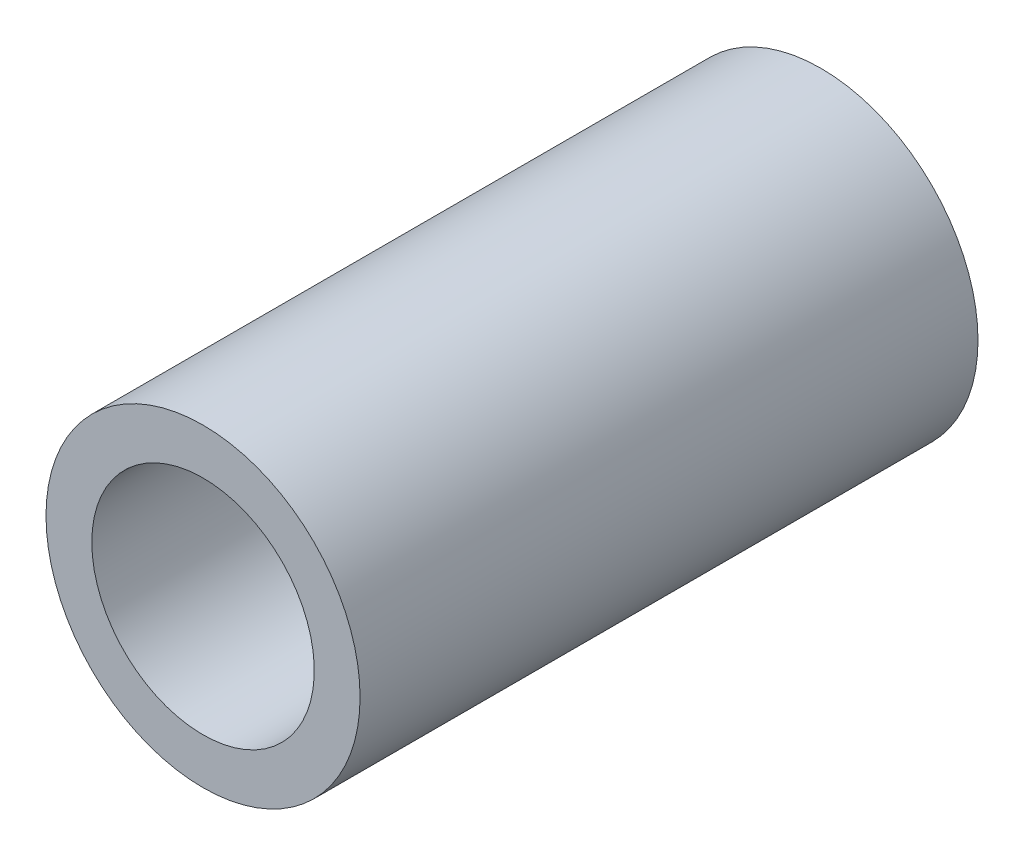
ISO-10303-21;
HEADER;
FILE_DESCRIPTION(('STEP AP214'),'2;1');
FILE_NAME('part.step','',(''),(''),'','','');
FILE_SCHEMA(('AUTOMOTIVE_DESIGN { 1 0 10303 214 1 1 1 1 }'));
ENDSEC;
DATA;
#1=APPLICATION_CONTEXT('core data for automotive mechanical design processes');
#2=APPLICATION_PROTOCOL_DEFINITION('international standard','automotive_design',2000,#1);
#3=PRODUCT_CONTEXT('',#1,'mechanical');
#4=PRODUCT('Part','Part','',(#3));
#5=PRODUCT_RELATED_PRODUCT_CATEGORY('part','',(#4));
#6=PRODUCT_DEFINITION_FORMATION('','',#4);
#7=PRODUCT_DEFINITION_CONTEXT('part definition',#1,'design');
#8=PRODUCT_DEFINITION('design','',#6,#7);
#9=PRODUCT_DEFINITION_SHAPE('','',#8);
#10=(LENGTH_UNIT() NAMED_UNIT(*) SI_UNIT(.MILLI.,.METRE.));
#11=(NAMED_UNIT(*) PLANE_ANGLE_UNIT() SI_UNIT($,.RADIAN.));
#12=(NAMED_UNIT(*) SI_UNIT($,.STERADIAN.) SOLID_ANGLE_UNIT());
#13=UNCERTAINTY_MEASURE_WITH_UNIT(LENGTH_MEASURE(1.E-05),#10,'distance_accuracy_value','');
#14=(GEOMETRIC_REPRESENTATION_CONTEXT(3) GLOBAL_UNCERTAINTY_ASSIGNED_CONTEXT((#13)) GLOBAL_UNIT_ASSIGNED_CONTEXT((#10,
#11,#12)) REPRESENTATION_CONTEXT('',''));
#15=CARTESIAN_POINT('',(0.,0.,0.));
#16=DIRECTION('',(0.,0.,1.));
#17=DIRECTION('',(1.,0.,0.));
#18=AXIS2_PLACEMENT_3D('',#15,#16,#17);
#19=CARTESIAN_POINT('',(0.,0.,23.61));
#20=DIRECTION('',(0.,0.,-1.));
#21=DIRECTION('',(-1.,0.,0.));
#22=AXIS2_PLACEMENT_3D('',#19,#20,#21);
#23=CYLINDRICAL_SURFACE('',#22,4.25);
#24=CARTESIAN_POINT('',(0.,0.,0.));
#25=DIRECTION('',(0.,0.,-1.));
#26=DIRECTION('',(-1.,0.,0.));
#27=AXIS2_PLACEMENT_3D('',#24,#25,#26);
#28=CIRCLE('',#27,4.25);
#29=CARTESIAN_POINT('',(-4.25,0.,0.));
#30=VERTEX_POINT('',#29);
#31=EDGE_CURVE('E27',#30,#30,#28,.T.);
#32=ORIENTED_EDGE('',*,*,#31,.T.);
#33=EDGE_LOOP('',(#32));
#34=FACE_BOUND('',#33,.T.);
#35=CARTESIAN_POINT('',(0.,0.,23.61));
#36=DIRECTION('',(0.,0.,-1.));
#37=DIRECTION('',(-1.,0.,0.));
#38=AXIS2_PLACEMENT_3D('',#35,#36,#37);
#39=CIRCLE('',#38,4.25);
#40=CARTESIAN_POINT('',(-4.25,0.,23.61));
#41=VERTEX_POINT('',#40);
#42=EDGE_CURVE('E18',#41,#41,#39,.T.);
#43=ORIENTED_EDGE('',*,*,#42,.F.);
#44=EDGE_LOOP('',(#43));
#45=FACE_BOUND('',#44,.T.);
#46=ADVANCED_FACE('F15',(#34,#45),#23,.F.);
#47=CARTESIAN_POINT('',(0.,0.,23.61));
#48=DIRECTION('',(0.,0.,1.));
#49=DIRECTION('',(1.,0.,0.));
#50=AXIS2_PLACEMENT_3D('',#47,#48,#49);
#51=PLANE('',#50);
#52=ORIENTED_EDGE('',*,*,#42,.T.);
#53=EDGE_LOOP('',(#52));
#54=FACE_BOUND('',#53,.T.);
#55=CARTESIAN_POINT('',(0.,0.,23.61));
#56=DIRECTION('',(0.,0.,-1.));
#57=DIRECTION('',(-1.,0.,0.));
#58=AXIS2_PLACEMENT_3D('',#55,#56,#57);
#59=CIRCLE('',#58,6.);
#60=CARTESIAN_POINT('',(-6.,0.,23.61));
#61=VERTEX_POINT('',#60);
#62=EDGE_CURVE('E22',#61,#61,#59,.T.);
#63=ORIENTED_EDGE('',*,*,#62,.F.);
#64=EDGE_LOOP('',(#63));
#65=FACE_BOUND('',#64,.T.);
#66=ADVANCED_FACE('F35',(#54,#65),#51,.T.);
#67=CARTESIAN_POINT('',(0.,0.,0.));
#68=DIRECTION('',(0.,0.,1.));
#69=DIRECTION('',(1.,0.,0.));
#70=AXIS2_PLACEMENT_3D('',#67,#68,#69);
#71=PLANE('',#70);
#72=ORIENTED_EDGE('',*,*,#31,.F.);
#73=EDGE_LOOP('',(#72));
#74=FACE_BOUND('',#73,.T.);
#75=CARTESIAN_POINT('',(0.,0.,0.));
#76=DIRECTION('',(0.,0.,-1.));
#77=DIRECTION('',(-1.,0.,0.));
#78=AXIS2_PLACEMENT_3D('',#75,#76,#77);
#79=CIRCLE('',#78,6.);
#80=CARTESIAN_POINT('',(-6.,0.,0.));
#81=VERTEX_POINT('',#80);
#82=EDGE_CURVE('E10',#81,#81,#79,.F.);
#83=ORIENTED_EDGE('',*,*,#82,.F.);
#84=EDGE_LOOP('',(#83));
#85=FACE_BOUND('',#84,.T.);
#86=ADVANCED_FACE('F43',(#74,#85),#71,.F.);
#87=CARTESIAN_POINT('',(0.,0.,23.61));
#88=DIRECTION('',(0.,0.,-1.));
#89=DIRECTION('',(-1.,0.,0.));
#90=AXIS2_PLACEMENT_3D('',#87,#88,#89);
#91=CYLINDRICAL_SURFACE('',#90,6.);
#92=ORIENTED_EDGE('',*,*,#82,.T.);
#93=EDGE_LOOP('',(#92));
#94=FACE_BOUND('',#93,.T.);
#95=ORIENTED_EDGE('',*,*,#62,.T.);
#96=EDGE_LOOP('',(#95));
#97=FACE_BOUND('',#96,.T.);
#98=ADVANCED_FACE('F44',(#94,#97),#91,.T.);
#99=CLOSED_SHELL('',(#46,#66,#86,#98));
#100=MANIFOLD_SOLID_BREP('B1',#99);
#101=ADVANCED_BREP_SHAPE_REPRESENTATION('',(#18,#100),#14);
#102=SHAPE_DEFINITION_REPRESENTATION(#9,#101);
ENDSEC;
END-ISO-10303-21;
